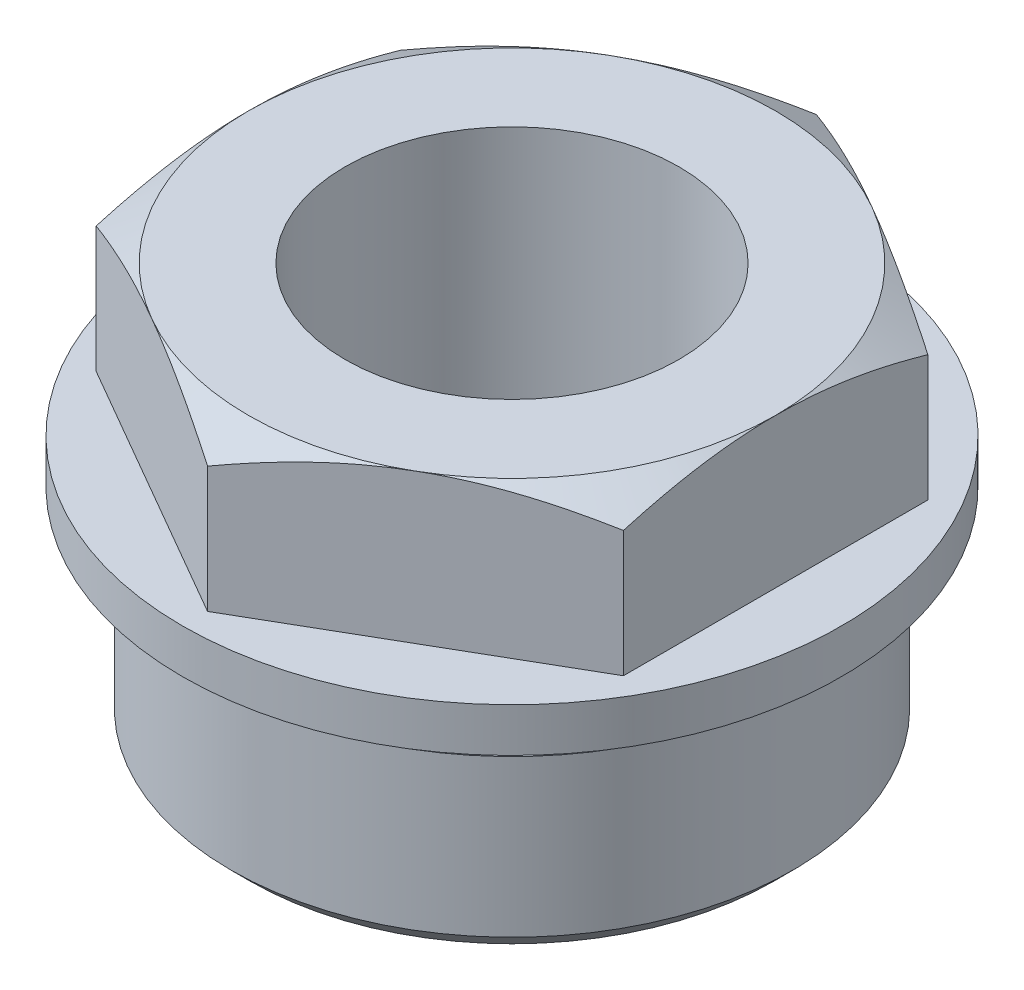
ISO-10303-21;
HEADER;
FILE_DESCRIPTION(('STEP AP214'),'2;1');
FILE_NAME('part.step','',(''),(''),'','','');
FILE_SCHEMA(('AUTOMOTIVE_DESIGN { 1 0 10303 214 1 1 1 1 }'));
ENDSEC;
DATA;
#1=APPLICATION_CONTEXT('core data for automotive mechanical design processes');
#2=APPLICATION_PROTOCOL_DEFINITION('international standard','automotive_design',2000,#1);
#3=PRODUCT_CONTEXT('',#1,'mechanical');
#4=PRODUCT('Part','Part','',(#3));
#5=PRODUCT_RELATED_PRODUCT_CATEGORY('part','',(#4));
#6=PRODUCT_DEFINITION_FORMATION('','',#4);
#7=PRODUCT_DEFINITION_CONTEXT('part definition',#1,'design');
#8=PRODUCT_DEFINITION('design','',#6,#7);
#9=PRODUCT_DEFINITION_SHAPE('','',#8);
#10=(LENGTH_UNIT() NAMED_UNIT(*) SI_UNIT(.MILLI.,.METRE.));
#11=(NAMED_UNIT(*) PLANE_ANGLE_UNIT() SI_UNIT($,.RADIAN.));
#12=(NAMED_UNIT(*) SI_UNIT($,.STERADIAN.) SOLID_ANGLE_UNIT());
#13=UNCERTAINTY_MEASURE_WITH_UNIT(LENGTH_MEASURE(1.E-05),#10,'distance_accuracy_value','');
#14=(GEOMETRIC_REPRESENTATION_CONTEXT(3) GLOBAL_UNCERTAINTY_ASSIGNED_CONTEXT((#13)) GLOBAL_UNIT_ASSIGNED_CONTEXT((#10,
#11,#12)) REPRESENTATION_CONTEXT('',''));
#15=CARTESIAN_POINT('',(0.,0.,0.));
#16=DIRECTION('',(0.,0.,1.));
#17=DIRECTION('',(1.,0.,0.));
#18=AXIS2_PLACEMENT_3D('',#15,#16,#17);
#19=CARTESIAN_POINT('',(26.5000000000002,46.,0.));
#20=DIRECTION('',(0.,-1.,0.));
#21=DIRECTION('',(0.,0.,-1.00000000000001));
#22=AXIS2_PLACEMENT_3D('',#19,#20,#21);
#23=PLANE('',#22);
#24=CARTESIAN_POINT('',(0.,46.,0.));
#25=DIRECTION('',(0.,1.,0.));
#26=DIRECTION('',(0.,0.,1.00000000000001));
#27=AXIS2_PLACEMENT_3D('',#24,#25,#26);
#28=CIRCLE('',#27,19.);
#29=CARTESIAN_POINT('',(0.,46.,19.0000000000001));
#30=VERTEX_POINT('',#29);
#31=EDGE_CURVE('E270',#30,#30,#28,.T.);
#32=ORIENTED_EDGE('',*,*,#31,.F.);
#33=EDGE_LOOP('',(#32));
#34=FACE_BOUND('',#33,.T.);
#35=CARTESIAN_POINT('',(0.,46.,0.));
#36=DIRECTION('',(0.,-1.,0.));
#37=DIRECTION('',(0.,0.,-1.00000000000001));
#38=AXIS2_PLACEMENT_3D('',#35,#36,#37);
#39=CIRCLE('',#38,30.);
#40=CARTESIAN_POINT('',(15.0000000000001,46.,-25.9807621135334));
#41=VERTEX_POINT('',#40);
#42=CARTESIAN_POINT('',(30.0000000000002,46.,0.));
#43=VERTEX_POINT('',#42);
#44=EDGE_CURVE('E68',#41,#43,#39,.T.);
#45=ORIENTED_EDGE('',*,*,#44,.F.);
#46=CARTESIAN_POINT('',(-15.0000000000001,46.,-25.9807621135334));
#47=VERTEX_POINT('',#46);
#48=EDGE_CURVE('E155',#47,#41,#39,.T.);
#49=ORIENTED_EDGE('',*,*,#48,.F.);
#50=CARTESIAN_POINT('',(-30.0000000000002,46.,0.));
#51=VERTEX_POINT('',#50);
#52=EDGE_CURVE('E152',#51,#47,#39,.T.);
#53=ORIENTED_EDGE('',*,*,#52,.F.);
#54=CARTESIAN_POINT('',(-15.0000000000001,46.,25.9807621135334));
#55=VERTEX_POINT('',#54);
#56=EDGE_CURVE('E151',#55,#51,#39,.T.);
#57=ORIENTED_EDGE('',*,*,#56,.F.);
#58=CARTESIAN_POINT('',(15.0000000000001,46.,25.9807621135334));
#59=VERTEX_POINT('',#58);
#60=EDGE_CURVE('E131',#59,#55,#39,.T.);
#61=ORIENTED_EDGE('',*,*,#60,.F.);
#62=EDGE_CURVE('E121',#43,#59,#39,.T.);
#63=ORIENTED_EDGE('',*,*,#62,.F.);
#64=EDGE_LOOP('',(#45,#49,#53,#57,#61,#63));
#65=FACE_BOUND('',#64,.T.);
#66=ADVANCED_FACE('F49',(#34,#65),#23,.F.);
#67=CARTESIAN_POINT('',(30.0000000000002,46.,17.3205080756889));
#68=DIRECTION('',(-1.00000000000001,0.,0.));
#69=DIRECTION('',(0.,0.,1.00000000000001));
#70=AXIS2_PLACEMENT_3D('',#67,#68,#69);
#71=PLANE('',#70);
#72=CARTESIAN_POINT('',(30.0000000000001,31.239606090176,-46.7712819646018));
#73=CARTESIAN_POINT('',(30.0000000000002,31.5584687448088,-46.1151297675261));
#74=CARTESIAN_POINT('',(30.0000000000002,31.8757643867478,-45.4582138124259));
#75=CARTESIAN_POINT('',(30.0000000000002,32.5068572860207,-44.1426960555676));
#76=CARTESIAN_POINT('',(30.0000000000002,32.8206545089148,-43.4840942372916));
#77=CARTESIAN_POINT('',(30.0000000000002,33.4444271760729,-42.16495939762));
#78=CARTESIAN_POINT('',(30.0000000000002,33.7544020340731,-41.5044260987362));
#79=CARTESIAN_POINT('',(30.0000000000002,34.3700431687671,-40.1813574056565));
#80=CARTESIAN_POINT('',(30.0000000000002,34.6757094551645,-39.5188220159737));
#81=CARTESIAN_POINT('',(30.0000000000002,35.5887791275013,-37.5208295363821));
#82=CARTESIAN_POINT('',(30.0000000000002,36.1889082784954,-36.1820344642029));
#83=CARTESIAN_POINT('',(30.0000000000002,37.3649692433764,-33.4938786164809));
#84=CARTESIAN_POINT('',(30.0000000000002,37.9409021839278,-32.1445183363717));
#85=CARTESIAN_POINT('',(30.0000000000002,38.7909979851776,-30.0886765711821));
#86=CARTESIAN_POINT('',(30.0000000000002,39.0764148085031,-29.3868443951254));
#87=CARTESIAN_POINT('',(30.0000000000002,39.6379415544381,-27.9794711168769));
#88=CARTESIAN_POINT('',(30.0000000000002,39.914051614517,-27.2739300696465));
#89=CARTESIAN_POINT('',(30.0000000000002,40.4557471475397,-25.8587028040617));
#90=CARTESIAN_POINT('',(30.0000000000002,40.7213311997532,-25.1490160408786));
#91=CARTESIAN_POINT('',(30.0000000000002,41.240478478545,-23.7252560579688));
#92=CARTESIAN_POINT('',(30.0000000000002,41.4940417532633,-23.0111828558215));
#93=CARTESIAN_POINT('',(30.0000000000002,41.9869978610835,-21.5797436345363));
#94=CARTESIAN_POINT('',(30.0000000000002,42.226418146127,-20.8623871159705));
#95=CARTESIAN_POINT('',(30.0000000000002,42.6897530114855,-19.4226978318921));
#96=CARTESIAN_POINT('',(30.0000000000002,42.9136673272634,-18.7003649817126));
#97=CARTESIAN_POINT('',(30.0000000000002,43.5589575300168,-16.5258517009773));
#98=CARTESIAN_POINT('',(30.0000000000002,43.9540701330207,-15.0656156625462));
#99=CARTESIAN_POINT('',(30.0000000000002,44.4788191601853,-12.8635430521492));
#100=CARTESIAN_POINT('',(30.0000000000002,44.6420535379972,-12.1296310543223));
#101=CARTESIAN_POINT('',(30.0000000000002,44.9439641262004,-10.6567407203549));
#102=CARTESIAN_POINT('',(30.0000000000002,45.0826408291056,-9.91776248612859));
#103=CARTESIAN_POINT('',(30.0000000000002,45.3330012133777,-8.43525328781891));
#104=CARTESIAN_POINT('',(30.0000000000002,45.4446858599884,-7.69172248751187));
#105=CARTESIAN_POINT('',(30.0000000000002,45.6388508580685,-6.20083058790578));
#106=CARTESIAN_POINT('',(30.0000000000002,45.721331231571,-5.45346949149691));
#107=CARTESIAN_POINT('',(30.0000000000002,45.8543941047253,-3.96587006600816));
#108=CARTESIAN_POINT('',(30.0000000000002,45.9053844576528,-3.22566843529052));
#109=CARTESIAN_POINT('',(30.0000000000002,45.9760031688682,-1.74377072428046));
#110=CARTESIAN_POINT('',(30.0000000000002,45.9956320543405,-1.00207466931908));
#111=CARTESIAN_POINT('',(30.0000000000002,46.003064011847,0.481476307233653));
#112=CARTESIAN_POINT('',(30.0000000000002,45.9908670135502,1.22333122917246));
#113=CARTESIAN_POINT('',(30.0000000000002,45.9349326768346,2.70588775153423));
#114=CARTESIAN_POINT('',(30.0000000000002,45.8911939281505,3.44658929890457));
#115=CARTESIAN_POINT('',(30.0000000000002,45.790980313849,4.70266701347159));
#116=CARTESIAN_POINT('',(30.0000000000002,45.7423151475744,5.21868236424298));
#117=CARTESIAN_POINT('',(30.0000000000002,45.6306254228116,6.249162488353));
#118=CARTESIAN_POINT('',(30.0000000000002,45.5676004736487,6.76362721911927));
#119=CARTESIAN_POINT('',(30.0000000000002,45.3579018278731,8.30428874215557));
#120=CARTESIAN_POINT('',(30.0000000000002,45.1906061789717,9.32773034867537));
#121=CARTESIAN_POINT('',(30.0000000000002,44.8069407991703,11.3660247843504));
#122=CARTESIAN_POINT('',(30.0000000000002,44.5905335158633,12.3808704215439));
#123=CARTESIAN_POINT('',(30.0000000000002,44.1152707446625,14.4004832336886));
#124=CARTESIAN_POINT('',(30.0000000000002,43.8564158424033,15.4052505474839));
#125=CARTESIAN_POINT('',(30.0000000000002,43.2964152806087,17.4269084380743));
#126=CARTESIAN_POINT('',(30.0000000000002,42.9944578984081,18.4435724953574));
#127=CARTESIAN_POINT('',(30.0000000000002,42.358852378075,20.4668884277303));
#128=CARTESIAN_POINT('',(30.0000000000002,42.0252040282062,21.4735402358759));
#129=CARTESIAN_POINT('',(30.0000000000002,41.3315556576805,23.4773282017244));
#130=CARTESIAN_POINT('',(30.0000000000002,40.9715640722066,24.4744672908278));
#131=CARTESIAN_POINT('',(30.0000000000002,40.4150258557419,25.9639422432157));
#132=CARTESIAN_POINT('',(30.0000000000002,40.2267547362052,26.4593947158606));
#133=CARTESIAN_POINT('',(30.0000000000002,39.8451547473929,27.4483513648799));
#134=CARTESIAN_POINT('',(30.0000000000002,39.6518258624581,27.9418555352166));
#135=CARTESIAN_POINT('',(30.0000000000002,39.1837723709218,29.1203359232276));
#136=CARTESIAN_POINT('',(30.0000000000002,38.9068787245018,29.8044507215683));
#137=CARTESIAN_POINT('',(30.0000000000002,38.3451610691755,31.16942037891));
#138=CARTESIAN_POINT('',(30.0000000000002,38.0603369517343,31.8502751931459));
#139=CARTESIAN_POINT('',(30.0000000000002,37.1953226039201,33.8884385344727));
#140=CARTESIAN_POINT('',(30.0000000000002,36.6046135218582,35.2412881388174));
#141=CARTESIAN_POINT('',(30.0000000000002,35.400896481604,37.9373671896756));
#142=CARTESIAN_POINT('',(30.0000000000002,34.7878832368943,39.2805942639722));
#143=CARTESIAN_POINT('',(30.0000000000002,33.5440976205148,41.9587483647647));
#144=CARTESIAN_POINT('',(30.0000000000002,32.9133256560293,43.2936755807101));
#145=CARTESIAN_POINT('',(30.0000000000002,31.636659821909,45.958149444346));
#146=CARTESIAN_POINT('',(30.0000000000002,30.9907494270812,47.2876881579735));
#147=CARTESIAN_POINT('',(30.0000000000002,29.6871189830311,49.9409628653107));
#148=CARTESIAN_POINT('',(30.0000000000002,29.0293988792445,51.264698832175));
#149=CARTESIAN_POINT('',(30.0000000000002,27.7042847418028,53.907091228546));
#150=CARTESIAN_POINT('',(30.0000000000002,27.0368920227889,55.2257483180707));
#151=CARTESIAN_POINT('',(30.0000000000002,25.693958597624,57.8589000938369));
#152=CARTESIAN_POINT('',(30.0000000000002,25.0184179076171,59.173394788319));
#153=CARTESIAN_POINT('',(30.0000000000002,23.7186547125148,61.6863411406712));
#154=CARTESIAN_POINT('',(30.0000000000002,23.0949952422964,62.8850842385073));
#155=CARTESIAN_POINT('',(30.0000000000002,21.8427272486062,65.2799834863157));
#156=CARTESIAN_POINT('',(30.0000000000002,21.2141187171461,66.4761396321085));
#157=CARTESIAN_POINT('',(30.0000000000002,19.3218480221743,70.0613141116929));
#158=CARTESIAN_POINT('',(30.0000000000002,18.0517840515527,72.4469550235698));
#159=CARTESIAN_POINT('',(30.0000000000002,16.1385812103087,76.0170792666995));
#160=CARTESIAN_POINT('',(30.0000000000002,15.5003323985778,77.2041902670028));
#161=CARTESIAN_POINT('',(30.0000000000002,14.2209596587582,79.5768632930373));
#162=CARTESIAN_POINT('',(30.0000000000002,13.5798357296874,80.762425318239));
#163=CARTESIAN_POINT('',(30.0000000000002,12.2950866509177,83.1321046752538));
#164=CARTESIAN_POINT('',(30.0000000000002,11.6514616468602,84.3162220860654));
#165=CARTESIAN_POINT('',(30.0000000000002,10.3619460879779,86.6832203951813));
#166=CARTESIAN_POINT('',(30.0000000000002,9.7160555366616,87.866101295397));
#167=CARTESIAN_POINT('',(30.0000000000001,9.06916733564153,89.0484357879371));
#168=B_SPLINE_CURVE_WITH_KNOTS('',3,(#72,#73,#74,#75,#76,#77,#78,#79,#80,#81,#82,#83,#84,#85,
#86,#87,#88,#89,#90,#91,#92,#93,#94,#95,#96,#97,#98,#99,#100,#101,#102,#103,#104,#105,#106,#107,
#108,#109,#110,#111,#112,#113,#114,#115,#116,#117,#118,#119,#120,#121,#122,#123,#124,#125,#126,
#127,#128,#129,#130,#131,#132,#133,#134,#135,#136,#137,#138,#139,#140,#141,#142,#143,#144,#145,
#146,#147,#148,#149,#150,#151,#152,#153,#154,#155,#156,#157,#158,#159,#160,#161,#162,#163,#164,
#165,#166,#167),.UNSPECIFIED.,.F.,.F.,(4,2,2,2,2,2,2,2,2,2,2,2,2,2,2,2,2,2,2,2,2,2,2,2,2,2,2,2,
2,2,2,2,2,2,2,2,2,2,2,2,2,2,2,2,2,2,2,4),(0.,2.18858068266818,4.37718289159747,6.56611670840002,
8.75504559458201,13.1563067705084,17.5573627798744,19.8302541446687,22.103111922088,
24.3762754371637,26.6494298480528,28.9180162945692,31.186641434431,35.7221738109183,
37.9773813752811,40.2325437054496,42.4876253784291,44.7427053500612,46.9679292743305,
49.1931157923359,51.4183072277246,53.6435981599667,55.1983161665015,56.7530764760176,
59.8626647795073,62.9746388381711,66.0865699656556,69.2676306215483,72.4487125325011,
75.6287802713502,77.2188126469495,78.8088499460205,81.0228697118069,83.2369197931497,
87.6652067600132,92.0945502426658,96.523792248825,100.958117904936,105.392464054175,
109.826213063956,114.2599532904,118.313756266673,122.367565787572,130.475466895434,
134.518897380069,138.56232924618,142.605529083621,146.648722662373),.UNSPECIFIED.);
#169=CARTESIAN_POINT('',(30.0000000000002,43.3205080756888,17.3205080756889));
#170=VERTEX_POINT('',#169);
#171=EDGE_CURVE('E127',#170,#43,#168,.F.);
#172=ORIENTED_EDGE('',*,*,#171,.F.);
#173=DIRECTION('',(0.,-1.,0.));
#174=VECTOR('',#173,1.);
#175=CARTESIAN_POINT('',(30.0000000000002,137.651513899117,17.3205080756889));
#176=LINE('',#175,#174);
#177=CARTESIAN_POINT('',(30.0000000000001,29.,17.3205080756889));
#178=VERTEX_POINT('',#177);
#179=EDGE_CURVE('E147',#170,#178,#176,.T.);
#180=ORIENTED_EDGE('',*,*,#179,.T.);
#181=DIRECTION('',(0.,0.,-1.00000000000001));
#182=VECTOR('',#181,1.);
#183=CARTESIAN_POINT('',(30.0000000000001,29.,17.3205080756889));
#184=LINE('',#183,#182);
#185=CARTESIAN_POINT('',(30.0000000000001,29.,-17.3205080756889));
#186=VERTEX_POINT('',#185);
#187=EDGE_CURVE('E267',#178,#186,#184,.T.);
#188=ORIENTED_EDGE('',*,*,#187,.T.);
#189=DIRECTION('',(0.,-1.,0.));
#190=VECTOR('',#189,1.);
#191=CARTESIAN_POINT('',(30.0000000000002,137.651513899117,-17.3205080756888));
#192=LINE('',#191,#190);
#193=CARTESIAN_POINT('',(30.0000000000002,43.3205080756888,-17.3205080756889));
#194=VERTEX_POINT('',#193);
#195=EDGE_CURVE('E315',#194,#186,#192,.T.);
#196=ORIENTED_EDGE('',*,*,#195,.F.);
#197=EDGE_CURVE('E162',#43,#194,#168,.F.);
#198=ORIENTED_EDGE('',*,*,#197,.F.);
#199=EDGE_LOOP('',(#172,#180,#188,#196,#198));
#200=FACE_BOUND('',#199,.T.);
#201=ADVANCED_FACE('F178',(#200),#71,.F.);
#202=CARTESIAN_POINT('',(0.,46.,34.6410161513778));
#203=DIRECTION('',(-0.500000000000003,0.,-0.866025403784445));
#204=DIRECTION('',(-0.866025403784445,0.,0.500000000000003));
#205=AXIS2_PLACEMENT_3D('',#202,#203,#204);
#206=PLANE('',#205);
#207=CARTESIAN_POINT('',(-0.000199999999988119,43.3204414086888,34.6411316214316));
#208=CARTESIAN_POINT('',(0.659186525557407,43.5402203311054,34.260434633401));
#209=CARTESIAN_POINT('',(1.32114500943037,43.7500259061146,33.8782527245446));
#210=CARTESIAN_POINT('',(2.65037008425806,44.1469181469043,33.1108242697792));
#211=CARTESIAN_POINT('',(3.31763834458853,44.3339973405019,32.7255767600557));
#212=CARTESIAN_POINT('',(4.65878677635735,44.6829257656526,31.9512643519508));
#213=CARTESIAN_POINT('',(5.33267879099742,44.8447147472277,31.5621926158936));
#214=CARTESIAN_POINT('',(6.6851167611463,45.1395774383583,30.7813621897659));
#215=CARTESIAN_POINT('',(7.36366224608091,45.272654008486,30.3896037713815));
#216=CARTESIAN_POINT('',(8.70806302803091,45.504442984088,29.6134136180239));
#217=CARTESIAN_POINT('',(9.37381860500326,45.6039219186911,29.2290394564444));
#218=CARTESIAN_POINT('',(10.7083802826266,45.7707251166872,28.4585299126184));
#219=CARTESIAN_POINT('',(11.3771864417478,45.8380487611266,28.0723944966141));
#220=CARTESIAN_POINT('',(12.7159221665993,45.93884151169,27.2994750654973));
#221=CARTESIAN_POINT('',(13.3858494453991,45.9723508463518,26.9126923707448));
#222=CARTESIAN_POINT('',(14.7263223205433,46.0047942931646,26.1387699954389));
#223=CARTESIAN_POINT('',(15.3968678971403,46.003729473752,25.7516303262867));
#224=CARTESIAN_POINT('',(16.650459503705,45.9694399503114,25.0278688747828));
#225=CARTESIAN_POINT('',(17.2335948812431,45.9403965385324,24.6911955075871));
#226=CARTESIAN_POINT('',(18.3984749190376,45.8567123805129,24.0186517041928));
#227=CARTESIAN_POINT('',(18.9802195990946,45.8020720009268,23.6827812565623));
#228=CARTESIAN_POINT('',(20.1420964286621,45.6681440818065,23.0119713562463));
#229=CARTESIAN_POINT('',(20.722226639514,45.5888342550569,22.6770330228459));
#230=CARTESIAN_POINT('',(21.8797295892506,45.4069590542184,22.0087483832277));
#231=CARTESIAN_POINT('',(22.4571023398069,45.3043937786527,21.6754020702713));
#232=CARTESIAN_POINT('',(23.6213483105994,45.0751250350097,21.0032243456313));
#233=CARTESIAN_POINT('',(24.2081498990516,44.9479386998341,20.6644342905775));
#234=CARTESIAN_POINT('',(25.378161584323,44.6728211494683,19.9889277291311));
#235=CARTESIAN_POINT('',(25.961371183192,44.5248871227585,19.6522115102301));
#236=CARTESIAN_POINT('',(27.122831325468,44.2105128814925,18.981642184434));
#237=CARTESIAN_POINT('',(27.7010892596951,44.0441088802872,18.647784810447));
#238=CARTESIAN_POINT('',(28.8536055653687,43.6944548086621,17.9823792111209));
#239=CARTESIAN_POINT('',(29.4278650152743,43.5112094862418,17.6508303631332));
#240=CARTESIAN_POINT('',(30.0002000000002,43.3204414086888,17.320392605635));
#241=B_SPLINE_CURVE_WITH_KNOTS('',3,(#207,#208,#209,#210,#211,#212,#213,#214,#215,#216,#217,
#218,#219,#220,#221,#222,#223,#224,#225,#226,#227,#228,#229,#230,#231,#232,#233,#234,#235,#236,
#237,#238,#239,#240),.UNSPECIFIED.,.F.,.F.,(4,2,2,2,2,2,2,2,2,2,2,2,2,2,2,2,4),(0.,
2.37750032904935,4.75578025029283,7.13964242705026,9.52326699360544,11.8481083974673,
14.172994550143,16.4951115370995,18.8171567643376,20.8385880600118,22.8599904013275,
24.8832242763788,26.9064495800128,28.9743372865567,31.042505483789,33.1066880391163,
35.1702904233234),.UNSPECIFIED.);
#242=CARTESIAN_POINT('',(0.,43.3205080756888,34.6410161513777));
#243=VERTEX_POINT('',#242);
#244=EDGE_CURVE('E135',#243,#59,#241,.T.);
#245=ORIENTED_EDGE('',*,*,#244,.F.);
#246=DIRECTION('',(0.,-1.,0.));
#247=VECTOR('',#246,1.);
#248=CARTESIAN_POINT('',(0.,137.651513899117,34.6410161513776));
#249=LINE('',#248,#247);
#250=CARTESIAN_POINT('',(0.,29.,34.6410161513778));
#251=VERTEX_POINT('',#250);
#252=EDGE_CURVE('E322',#243,#251,#249,.T.);
#253=ORIENTED_EDGE('',*,*,#252,.T.);
#254=DIRECTION('',(0.866025403784445,0.,-0.500000000000003));
#255=VECTOR('',#254,1.);
#256=CARTESIAN_POINT('',(0.,29.,34.6410161513778));
#257=LINE('',#256,#255);
#258=EDGE_CURVE('E273',#251,#178,#257,.T.);
#259=ORIENTED_EDGE('',*,*,#258,.T.);
#260=ORIENTED_EDGE('',*,*,#179,.F.);
#261=EDGE_CURVE('E125',#59,#170,#241,.T.);
#262=ORIENTED_EDGE('',*,*,#261,.F.);
#263=EDGE_LOOP('',(#245,#253,#259,#260,#262));
#264=FACE_BOUND('',#263,.T.);
#265=ADVANCED_FACE('F145',(#264),#206,.F.);
#266=CARTESIAN_POINT('',(-30.0000000000002,46.,17.3205080756889));
#267=DIRECTION('',(0.500000000000003,0.,-0.866025403784445));
#268=DIRECTION('',(-0.866025403784445,0.,-0.500000000000004));
#269=AXIS2_PLACEMENT_3D('',#266,#267,#268);
#270=PLANE('',#269);
#271=CARTESIAN_POINT('',(-30.0002000000002,43.3204414086888,17.320392605635));
#272=CARTESIAN_POINT('',(-29.3408134744428,43.5402203311054,17.7010895936656));
#273=CARTESIAN_POINT('',(-28.6788549905698,43.7500259061146,18.083271502522));
#274=CARTESIAN_POINT('',(-27.3496299157421,44.1469181469043,18.8506999572874));
#275=CARTESIAN_POINT('',(-26.6823616554116,44.333997340502,19.2359474670109));
#276=CARTESIAN_POINT('',(-25.3412132236428,44.6829257656526,20.0102598751159));
#277=CARTESIAN_POINT('',(-24.6673212090027,44.8447147472277,20.399331611173));
#278=CARTESIAN_POINT('',(-23.3148832388539,45.1395774383583,21.1801620373008));
#279=CARTESIAN_POINT('',(-22.6363377539193,45.272654008486,21.5719204556852));
#280=CARTESIAN_POINT('',(-21.2919369719693,45.5044429840881,22.3481106090428));
#281=CARTESIAN_POINT('',(-20.6261813949969,45.6039219186911,22.7324847706222));
#282=CARTESIAN_POINT('',(-19.2916197173735,45.7707251166872,23.5029943144482));
#283=CARTESIAN_POINT('',(-18.6228135582523,45.8380487611266,23.8891297304526));
#284=CARTESIAN_POINT('',(-17.2840778334008,45.9388415116901,24.6620491615693));
#285=CARTESIAN_POINT('',(-16.6141505546011,45.9723508463518,25.0488318563218));
#286=CARTESIAN_POINT('',(-15.2736776794569,46.0047942931646,25.8227542316278));
#287=CARTESIAN_POINT('',(-14.6031321028598,46.003729473752,26.20989390078));
#288=CARTESIAN_POINT('',(-13.3495404962952,45.9694399503114,26.933655352284));
#289=CARTESIAN_POINT('',(-12.7664051187571,45.9403965385324,27.2703287194795));
#290=CARTESIAN_POINT('',(-11.6015250809625,45.856712380513,27.9428725228738));
#291=CARTESIAN_POINT('',(-11.0197804009055,45.8020720009268,28.2787429705044));
#292=CARTESIAN_POINT('',(-9.85790357133802,45.6681440818065,28.9495528708204));
#293=CARTESIAN_POINT('',(-9.27777336048611,45.588834255057,29.2844912042207));
#294=CARTESIAN_POINT('',(-8.12027041074949,45.4069590542184,29.952775843839));
#295=CARTESIAN_POINT('',(-7.5428976601932,45.3043937786527,30.2861221567954));
#296=CARTESIAN_POINT('',(-6.3786516894007,45.0751250350097,30.9582998814354));
#297=CARTESIAN_POINT('',(-5.79185010094859,44.9479386998342,31.2970899364891));
#298=CARTESIAN_POINT('',(-4.62183841567714,44.6728211494683,31.9725964979356));
#299=CARTESIAN_POINT('',(-4.03862881680816,44.5248871227585,32.3093127168366));
#300=CARTESIAN_POINT('',(-2.8771686745322,44.2105128814925,32.9798820426326));
#301=CARTESIAN_POINT('',(-2.29891074030503,44.0441088802872,33.3137394166197));
#302=CARTESIAN_POINT('',(-1.14639443463143,43.6944548086621,33.9791450159458));
#303=CARTESIAN_POINT('',(-0.572134984725888,43.5112094862418,34.3106938639334));
#304=CARTESIAN_POINT('',(0.000200000000012978,43.3204414086888,34.6411316214316));
#305=B_SPLINE_CURVE_WITH_KNOTS('',3,(#271,#272,#273,#274,#275,#276,#277,#278,#279,#280,#281,
#282,#283,#284,#285,#286,#287,#288,#289,#290,#291,#292,#293,#294,#295,#296,#297,#298,#299,#300,
#301,#302,#303,#304),.UNSPECIFIED.,.F.,.F.,(4,2,2,2,2,2,2,2,2,2,2,2,2,2,2,2,4),(0.,
2.37750032904935,4.75578025029285,7.13964242705028,9.52326699360546,11.8481083974673,
14.172994550143,16.4951115370995,18.8171567643376,20.8385880600118,22.8599904013275,
24.8832242763788,26.9064495800128,28.9743372865567,31.0425054837891,33.1066880391164,
35.1702904233234),.UNSPECIFIED.);
#306=CARTESIAN_POINT('',(-30.0000000000002,43.3205080756888,17.3205080756889));
#307=VERTEX_POINT('',#306);
#308=EDGE_CURVE('E318',#307,#55,#305,.T.);
#309=ORIENTED_EDGE('',*,*,#308,.F.);
#310=DIRECTION('',(0.,-1.,0.));
#311=VECTOR('',#310,1.);
#312=CARTESIAN_POINT('',(-30.0000000000002,137.651513899117,17.3205080756889));
#313=LINE('',#312,#311);
#314=CARTESIAN_POINT('',(-30.0000000000002,29.,17.3205080756889));
#315=VERTEX_POINT('',#314);
#316=EDGE_CURVE('E316',#307,#315,#313,.T.);
#317=ORIENTED_EDGE('',*,*,#316,.T.);
#318=DIRECTION('',(0.866025403784445,0.,0.500000000000004));
#319=VECTOR('',#318,1.);
#320=CARTESIAN_POINT('',(-30.0000000000002,29.,17.3205080756889));
#321=LINE('',#320,#319);
#322=EDGE_CURVE('E331',#315,#251,#321,.T.);
#323=ORIENTED_EDGE('',*,*,#322,.T.);
#324=ORIENTED_EDGE('',*,*,#252,.F.);
#325=EDGE_CURVE('E139',#55,#243,#305,.T.);
#326=ORIENTED_EDGE('',*,*,#325,.F.);
#327=EDGE_LOOP('',(#309,#317,#323,#324,#326));
#328=FACE_BOUND('',#327,.T.);
#329=ADVANCED_FACE('F200',(#328),#270,.F.);
#330=CARTESIAN_POINT('',(-30.0000000000002,46.,-17.3205080756889));
#331=DIRECTION('',(1.00000000000001,0.,0.));
#332=DIRECTION('',(0.,0.,-1.00000000000001));
#333=AXIS2_PLACEMENT_3D('',#330,#331,#332);
#334=PLANE('',#333);
#335=CARTESIAN_POINT('',(-30.0000000000002,31.239606090176,-46.7712819646018));
#336=CARTESIAN_POINT('',(-30.0000000000002,31.5584687448088,-46.1151297675261));
#337=CARTESIAN_POINT('',(-30.0000000000002,31.8757643867478,-45.4582138124259));
#338=CARTESIAN_POINT('',(-30.0000000000002,32.5068572860208,-44.1426960555676));
#339=CARTESIAN_POINT('',(-30.0000000000002,32.8206545089148,-43.4840942372916));
#340=CARTESIAN_POINT('',(-30.0000000000002,33.4444271760729,-42.16495939762));
#341=CARTESIAN_POINT('',(-30.0000000000002,33.7544020340731,-41.5044260987362));
#342=CARTESIAN_POINT('',(-30.0000000000002,34.3700431687671,-40.1813574056565));
#343=CARTESIAN_POINT('',(-30.0000000000002,34.6757094551645,-39.5188220159737));
#344=CARTESIAN_POINT('',(-30.0000000000002,35.5887791275013,-37.5208295363821));
#345=CARTESIAN_POINT('',(-30.0000000000002,36.1889082784954,-36.1820344642029));
#346=CARTESIAN_POINT('',(-30.0000000000002,37.3649692433764,-33.4938786164808));
#347=CARTESIAN_POINT('',(-30.0000000000002,37.9409021839278,-32.1445183363717));
#348=CARTESIAN_POINT('',(-30.0000000000002,38.7909979851776,-30.0886765711821));
#349=CARTESIAN_POINT('',(-30.0000000000002,39.0764148085031,-29.3868443951254));
#350=CARTESIAN_POINT('',(-30.0000000000002,39.6379415544381,-27.9794711168769));
#351=CARTESIAN_POINT('',(-30.0000000000002,39.914051614517,-27.2739300696465));
#352=CARTESIAN_POINT('',(-30.0000000000002,40.4557471475397,-25.8587028040617));
#353=CARTESIAN_POINT('',(-30.0000000000002,40.7213311997532,-25.1490160408786));
#354=CARTESIAN_POINT('',(-30.0000000000002,41.240478478545,-23.7252560579687));
#355=CARTESIAN_POINT('',(-30.0000000000002,41.4940417532633,-23.0111828558215));
#356=CARTESIAN_POINT('',(-30.0000000000002,41.9869978610835,-21.5797436345363));
#357=CARTESIAN_POINT('',(-30.0000000000002,42.226418146127,-20.8623871159705));
#358=CARTESIAN_POINT('',(-30.0000000000002,42.6897530114855,-19.4226978318921));
#359=CARTESIAN_POINT('',(-30.0000000000002,42.9136673272634,-18.7003649817126));
#360=CARTESIAN_POINT('',(-30.0000000000002,43.5589575300168,-16.5258517009773));
#361=CARTESIAN_POINT('',(-30.0000000000002,43.9540701330207,-15.0656156625462));
#362=CARTESIAN_POINT('',(-30.0000000000002,44.4788191601853,-12.8635430521491));
#363=CARTESIAN_POINT('',(-30.0000000000002,44.6420535379972,-12.1296310543223));
#364=CARTESIAN_POINT('',(-30.0000000000002,44.9439641262005,-10.6567407203549));
#365=CARTESIAN_POINT('',(-30.0000000000002,45.0826408291056,-9.91776248612856));
#366=CARTESIAN_POINT('',(-30.0000000000002,45.3330012133777,-8.43525328781887));
#367=CARTESIAN_POINT('',(-30.0000000000002,45.4446858599884,-7.69172248751184));
#368=CARTESIAN_POINT('',(-30.0000000000002,45.6388508580685,-6.20083058790574));
#369=CARTESIAN_POINT('',(-30.0000000000002,45.721331231571,-5.45346949149688));
#370=CARTESIAN_POINT('',(-30.0000000000002,45.8543941047253,-3.96587006600813));
#371=CARTESIAN_POINT('',(-30.0000000000002,45.9053844576528,-3.22566843529049));
#372=CARTESIAN_POINT('',(-30.0000000000002,45.9760031688682,-1.74377072428043));
#373=CARTESIAN_POINT('',(-30.0000000000002,45.9956320543405,-1.00207466931905));
#374=CARTESIAN_POINT('',(-30.0000000000002,46.003064011847,0.481476307233685));
#375=CARTESIAN_POINT('',(-30.0000000000002,45.9908670135502,1.22333122917249));
#376=CARTESIAN_POINT('',(-30.0000000000002,45.9349326768346,2.70588775153427));
#377=CARTESIAN_POINT('',(-30.0000000000002,45.8911939281505,3.44658929890459));
#378=CARTESIAN_POINT('',(-30.0000000000002,45.790980313849,4.70266701347162));
#379=CARTESIAN_POINT('',(-30.0000000000002,45.7423151475744,5.218682364243));
#380=CARTESIAN_POINT('',(-30.0000000000002,45.6306254228116,6.24916248835302));
#381=CARTESIAN_POINT('',(-30.0000000000002,45.5676004736487,6.76362721911929));
#382=CARTESIAN_POINT('',(-30.0000000000002,45.3579018278731,8.30428874215559));
#383=CARTESIAN_POINT('',(-30.0000000000002,45.1906061789717,9.3277303486754));
#384=CARTESIAN_POINT('',(-30.0000000000002,44.8069407991703,11.3660247843504));
#385=CARTESIAN_POINT('',(-30.0000000000002,44.5905335158633,12.3808704215439));
#386=CARTESIAN_POINT('',(-30.0000000000002,44.1152707446625,14.4004832336886));
#387=CARTESIAN_POINT('',(-30.0000000000002,43.8564158424032,15.4052505474839));
#388=CARTESIAN_POINT('',(-30.0000000000002,43.2964152806087,17.4269084380743));
#389=CARTESIAN_POINT('',(-30.0000000000002,42.9944578984081,18.4435724953574));
#390=CARTESIAN_POINT('',(-30.0000000000002,42.358852378075,20.4668884277304));
#391=CARTESIAN_POINT('',(-30.0000000000002,42.0252040282062,21.473540235876));
#392=CARTESIAN_POINT('',(-30.0000000000002,41.3315556576804,23.4773282017245));
#393=CARTESIAN_POINT('',(-30.0000000000002,40.9715640722066,24.4744672908278));
#394=CARTESIAN_POINT('',(-30.0000000000002,40.4150258557419,25.9639422432158));
#395=CARTESIAN_POINT('',(-30.0000000000002,40.2267547362051,26.4593947158607));
#396=CARTESIAN_POINT('',(-30.0000000000002,39.8451547473929,27.4483513648799));
#397=CARTESIAN_POINT('',(-30.0000000000002,39.6518258624581,27.9418555352166));
#398=CARTESIAN_POINT('',(-30.0000000000002,39.1837723709218,29.1203359232277));
#399=CARTESIAN_POINT('',(-30.0000000000002,38.9068787245018,29.8044507215684));
#400=CARTESIAN_POINT('',(-30.0000000000002,38.3451610691754,31.1694203789101));
#401=CARTESIAN_POINT('',(-30.0000000000002,38.0603369517342,31.8502751931459));
#402=CARTESIAN_POINT('',(-30.0000000000002,37.1953226039201,33.8884385344728));
#403=CARTESIAN_POINT('',(-30.0000000000002,36.6046135218582,35.2412881388174));
#404=CARTESIAN_POINT('',(-30.0000000000002,35.400896481604,37.9373671896757));
#405=CARTESIAN_POINT('',(-30.0000000000002,34.7878832368942,39.2805942639723));
#406=CARTESIAN_POINT('',(-30.0000000000002,33.5440976205147,41.9587483647648));
#407=CARTESIAN_POINT('',(-30.0000000000002,32.9133256560292,43.2936755807102));
#408=CARTESIAN_POINT('',(-30.0000000000002,31.6366598219089,45.9581494443461));
#409=CARTESIAN_POINT('',(-30.0000000000002,30.9907494270812,47.2876881579735));
#410=CARTESIAN_POINT('',(-30.0000000000002,29.6871189830311,49.9409628653108));
#411=CARTESIAN_POINT('',(-30.0000000000002,29.0293988792445,51.264698832175));
#412=CARTESIAN_POINT('',(-30.0000000000002,27.7042847418028,53.9070912285461));
#413=CARTESIAN_POINT('',(-30.0000000000002,27.0368920227888,55.2257483180707));
#414=CARTESIAN_POINT('',(-30.0000000000002,25.693958597624,57.8589000938369));
#415=CARTESIAN_POINT('',(-30.0000000000002,25.0184179076171,59.1733947883191));
#416=CARTESIAN_POINT('',(-30.0000000000002,23.7186547125148,61.6863411406712));
#417=CARTESIAN_POINT('',(-30.0000000000002,23.0949952422963,62.8850842385073));
#418=CARTESIAN_POINT('',(-30.0000000000002,21.8427272486061,65.2799834863158));
#419=CARTESIAN_POINT('',(-30.0000000000002,21.2141187171461,66.4761396321086));
#420=CARTESIAN_POINT('',(-30.0000000000002,19.3218480221743,70.0613141116929));
#421=CARTESIAN_POINT('',(-30.0000000000002,18.0517840515527,72.4469550235698));
#422=CARTESIAN_POINT('',(-30.0000000000002,16.1385812103087,76.0170792666995));
#423=CARTESIAN_POINT('',(-30.0000000000002,15.5003323985778,77.2041902670028));
#424=CARTESIAN_POINT('',(-30.0000000000002,14.2209596587582,79.5768632930373));
#425=CARTESIAN_POINT('',(-30.0000000000002,13.5798357296874,80.762425318239));
#426=CARTESIAN_POINT('',(-30.0000000000002,12.2950866509177,83.1321046752538));
#427=CARTESIAN_POINT('',(-30.0000000000002,11.6514616468602,84.3162220860654));
#428=CARTESIAN_POINT('',(-30.0000000000002,10.3619460879779,86.6832203951814));
#429=CARTESIAN_POINT('',(-30.0000000000002,9.71605553666159,87.866101295397));
#430=CARTESIAN_POINT('',(-30.0000000000002,9.06916733564152,89.0484357879371));
#431=B_SPLINE_CURVE_WITH_KNOTS('',3,(#335,#336,#337,#338,#339,#340,#341,#342,#343,#344,#345,
#346,#347,#348,#349,#350,#351,#352,#353,#354,#355,#356,#357,#358,#359,#360,#361,#362,#363,#364,
#365,#366,#367,#368,#369,#370,#371,#372,#373,#374,#375,#376,#377,#378,#379,#380,#381,#382,#383,
#384,#385,#386,#387,#388,#389,#390,#391,#392,#393,#394,#395,#396,#397,#398,#399,#400,#401,#402,
#403,#404,#405,#406,#407,#408,#409,#410,#411,#412,#413,#414,#415,#416,#417,#418,#419,#420,#421,
#422,#423,#424,#425,#426,#427,#428,#429,#430),.UNSPECIFIED.,.F.,.F.,(4,2,2,2,2,2,2,2,2,2,2,2,2,
2,2,2,2,2,2,2,2,2,2,2,2,2,2,2,2,2,2,2,2,2,2,2,2,2,2,2,2,2,2,2,2,2,2,4),(0.,2.18858068266818,
4.37718289159747,6.56611670840001,8.75504559458202,13.1563067705084,17.5573627798744,
19.8302541446687,22.103111922088,24.3762754371637,26.6494298480528,28.9180162945692,
31.186641434431,35.7221738109184,37.9773813752811,40.2325437054497,42.4876253784291,
44.7427053500613,46.9679292743305,49.1931157923359,51.4183072277246,53.6435981599667,
55.1983161665015,56.7530764760176,59.8626647795074,62.9746388381711,66.0865699656556,
69.2676306215484,72.4487125325011,75.6287802713503,77.2188126469495,78.8088499460206,
81.0228697118069,83.2369197931498,87.6652067600132,92.0945502426658,96.523792248825,
100.958117904936,105.392464054176,109.826213063956,114.2599532904,118.313756266673,
122.367565787572,130.475466895434,134.518897380069,138.56232924618,142.605529083621,
146.648722662373),.UNSPECIFIED.);
#432=CARTESIAN_POINT('',(-30.0000000000002,43.3205080756888,-17.3205080756889));
#433=VERTEX_POINT('',#432);
#434=EDGE_CURVE('E148',#433,#51,#431,.T.);
#435=ORIENTED_EDGE('',*,*,#434,.F.);
#436=DIRECTION('',(0.,-1.,0.));
#437=VECTOR('',#436,1.);
#438=CARTESIAN_POINT('',(-30.0000000000002,137.651513899117,-17.3205080756888));
#439=LINE('',#438,#437);
#440=CARTESIAN_POINT('',(-30.0000000000002,29.,-17.3205080756889));
#441=VERTEX_POINT('',#440);
#442=EDGE_CURVE('E314',#433,#441,#439,.T.);
#443=ORIENTED_EDGE('',*,*,#442,.T.);
#444=DIRECTION('',(0.,0.,1.00000000000001));
#445=VECTOR('',#444,1.);
#446=CARTESIAN_POINT('',(-30.0000000000002,29.,-17.3205080756889));
#447=LINE('',#446,#445);
#448=EDGE_CURVE('E328',#441,#315,#447,.T.);
#449=ORIENTED_EDGE('',*,*,#448,.T.);
#450=ORIENTED_EDGE('',*,*,#316,.F.);
#451=EDGE_CURVE('E142',#51,#307,#431,.T.);
#452=ORIENTED_EDGE('',*,*,#451,.F.);
#453=EDGE_LOOP('',(#435,#443,#449,#450,#452));
#454=FACE_BOUND('',#453,.T.);
#455=ADVANCED_FACE('F203',(#454),#334,.F.);
#456=CARTESIAN_POINT('',(0.,46.,-34.6410161513778));
#457=DIRECTION('',(0.500000000000003,0.,0.866025403784445));
#458=DIRECTION('',(0.866025403784445,0.,-0.500000000000004));
#459=AXIS2_PLACEMENT_3D('',#456,#457,#458);
#460=PLANE('',#459);
#461=CARTESIAN_POINT('',(0.000199999999988692,43.3204414086888,-34.6411316214316));
#462=CARTESIAN_POINT('',(-0.659186525557405,43.5402203311054,-34.260434633401));
#463=CARTESIAN_POINT('',(-1.32114500943037,43.7500259061146,-33.8782527245446));
#464=CARTESIAN_POINT('',(-2.65037008425805,44.1469181469043,-33.1108242697792));
#465=CARTESIAN_POINT('',(-3.31763834458852,44.3339973405019,-32.7255767600558));
#466=CARTESIAN_POINT('',(-4.65878677635734,44.6829257656526,-31.9512643519508));
#467=CARTESIAN_POINT('',(-5.33267879099741,44.8447147472277,-31.5621926158936));
#468=CARTESIAN_POINT('',(-6.68511676114629,45.1395774383583,-30.7813621897659));
#469=CARTESIAN_POINT('',(-7.3636622460809,45.272654008486,-30.3896037713815));
#470=CARTESIAN_POINT('',(-8.7080630280309,45.504442984088,-29.6134136180239));
#471=CARTESIAN_POINT('',(-9.37381860500325,45.6039219186911,-29.2290394564444));
#472=CARTESIAN_POINT('',(-10.7083802826266,45.7707251166872,-28.4585299126184));
#473=CARTESIAN_POINT('',(-11.3771864417478,45.8380487611266,-28.0723944966141));
#474=CARTESIAN_POINT('',(-12.7159221665993,45.93884151169,-27.2994750654973));
#475=CARTESIAN_POINT('',(-13.3858494453991,45.9723508463518,-26.9126923707448));
#476=CARTESIAN_POINT('',(-14.7263223205433,46.0047942931646,-26.1387699954389));
#477=CARTESIAN_POINT('',(-15.3968678971403,46.003729473752,-25.7516303262867));
#478=CARTESIAN_POINT('',(-16.650459503705,45.9694399503114,-25.0278688747828));
#479=CARTESIAN_POINT('',(-17.2335948812431,45.9403965385324,-24.6911955075871));
#480=CARTESIAN_POINT('',(-18.3984749190376,45.856712380513,-24.0186517041928));
#481=CARTESIAN_POINT('',(-18.9802195990946,45.8020720009268,-23.6827812565623));
#482=CARTESIAN_POINT('',(-20.1420964286621,45.6681440818065,-23.0119713562463));
#483=CARTESIAN_POINT('',(-20.722226639514,45.5888342550569,-22.6770330228459));
#484=CARTESIAN_POINT('',(-21.8797295892506,45.4069590542184,-22.0087483832277));
#485=CARTESIAN_POINT('',(-22.4571023398069,45.3043937786527,-21.6754020702713));
#486=CARTESIAN_POINT('',(-23.6213483105994,45.0751250350097,-21.0032243456313));
#487=CARTESIAN_POINT('',(-24.2081498990516,44.9479386998342,-20.6644342905775));
#488=CARTESIAN_POINT('',(-25.378161584323,44.6728211494683,-19.9889277291311));
#489=CARTESIAN_POINT('',(-25.961371183192,44.5248871227585,-19.6522115102301));
#490=CARTESIAN_POINT('',(-27.122831325468,44.2105128814925,-18.981642184434));
#491=CARTESIAN_POINT('',(-27.7010892596951,44.0441088802872,-18.6477848104469));
#492=CARTESIAN_POINT('',(-28.8536055653687,43.6944548086621,-17.9823792111209));
#493=CARTESIAN_POINT('',(-29.4278650152743,43.5112094862418,-17.6508303631332));
#494=CARTESIAN_POINT('',(-30.0002000000002,43.3204414086888,-17.320392605635));
#495=B_SPLINE_CURVE_WITH_KNOTS('',3,(#461,#462,#463,#464,#465,#466,#467,#468,#469,#470,#471,
#472,#473,#474,#475,#476,#477,#478,#479,#480,#481,#482,#483,#484,#485,#486,#487,#488,#489,#490,
#491,#492,#493,#494),.UNSPECIFIED.,.F.,.F.,(4,2,2,2,2,2,2,2,2,2,2,2,2,2,2,2,4),(0.,
2.37750032904935,4.75578025029282,7.13964242705025,9.52326699360543,11.8481083974673,
14.172994550143,16.4951115370995,18.8171567643375,20.8385880600118,22.8599904013275,
24.8832242763788,26.9064495800128,28.9743372865567,31.042505483789,33.1066880391163,
35.1702904233234),.UNSPECIFIED.);
#496=CARTESIAN_POINT('',(0.,43.3205080756888,-34.6410161513778));
#497=VERTEX_POINT('',#496);
#498=EDGE_CURVE('E154',#497,#47,#495,.T.);
#499=ORIENTED_EDGE('',*,*,#498,.F.);
#500=DIRECTION('',(0.,-1.,0.));
#501=VECTOR('',#500,1.);
#502=CARTESIAN_POINT('',(0.,137.651513899117,-34.6410161513778));
#503=LINE('',#502,#501);
#504=CARTESIAN_POINT('',(0.,29.,-34.6410161513778));
#505=VERTEX_POINT('',#504);
#506=EDGE_CURVE('E308',#497,#505,#503,.T.);
#507=ORIENTED_EDGE('',*,*,#506,.T.);
#508=DIRECTION('',(-0.866025403784444,0.,0.500000000000003));
#509=VECTOR('',#508,1.);
#510=CARTESIAN_POINT('',(0.,29.,-34.6410161513778));
#511=LINE('',#510,#509);
#512=EDGE_CURVE('E326',#505,#441,#511,.T.);
#513=ORIENTED_EDGE('',*,*,#512,.T.);
#514=ORIENTED_EDGE('',*,*,#442,.F.);
#515=EDGE_CURVE('E163',#47,#433,#495,.T.);
#516=ORIENTED_EDGE('',*,*,#515,.F.);
#517=EDGE_LOOP('',(#499,#507,#513,#514,#516));
#518=FACE_BOUND('',#517,.T.);
#519=ADVANCED_FACE('F169',(#518),#460,.F.);
#520=CARTESIAN_POINT('',(30.0000000000002,46.,-17.3205080756889));
#521=DIRECTION('',(-0.500000000000003,0.,0.866025403784445));
#522=DIRECTION('',(0.866025403784445,0.,0.500000000000003));
#523=AXIS2_PLACEMENT_3D('',#520,#521,#522);
#524=PLANE('',#523);
#525=CARTESIAN_POINT('',(30.0002000000002,43.3204414086888,-17.3203926056351));
#526=CARTESIAN_POINT('',(29.3408134744428,43.5402203311054,-17.7010895936656));
#527=CARTESIAN_POINT('',(28.6788549905698,43.7500259061146,-18.0832715025221));
#528=CARTESIAN_POINT('',(27.3496299157421,44.1469181469043,-18.8506999572874));
#529=CARTESIAN_POINT('',(26.6823616554116,44.3339973405019,-19.2359474670109));
#530=CARTESIAN_POINT('',(25.3412132236428,44.6829257656526,-20.0102598751159));
#531=CARTESIAN_POINT('',(24.6673212090028,44.8447147472277,-20.3993316111731));
#532=CARTESIAN_POINT('',(23.3148832388539,45.1395774383583,-21.1801620373008));
#533=CARTESIAN_POINT('',(22.6363377539193,45.272654008486,-21.5719204556852));
#534=CARTESIAN_POINT('',(21.2919369719693,45.504442984088,-22.3481106090428));
#535=CARTESIAN_POINT('',(20.6261813949969,45.6039219186911,-22.7324847706223));
#536=CARTESIAN_POINT('',(19.2916197173735,45.7707251166872,-23.5029943144483));
#537=CARTESIAN_POINT('',(18.6228135582523,45.8380487611266,-23.8891297304526));
#538=CARTESIAN_POINT('',(17.2840778334008,45.93884151169,-24.6620491615693));
#539=CARTESIAN_POINT('',(16.6141505546011,45.9723508463518,-25.0488318563219));
#540=CARTESIAN_POINT('',(15.2736776794568,46.0047942931646,-25.8227542316278));
#541=CARTESIAN_POINT('',(14.6031321028598,46.003729473752,-26.20989390078));
#542=CARTESIAN_POINT('',(13.3495404962952,45.9694399503114,-26.933655352284));
#543=CARTESIAN_POINT('',(12.7664051187571,45.9403965385324,-27.2703287194796));
#544=CARTESIAN_POINT('',(11.6015250809625,45.856712380513,-27.9428725228738));
#545=CARTESIAN_POINT('',(11.0197804009055,45.8020720009268,-28.2787429705044));
#546=CARTESIAN_POINT('',(9.85790357133802,45.6681440818065,-28.9495528708204));
#547=CARTESIAN_POINT('',(9.27777336048611,45.5888342550569,-29.2844912042208));
#548=CARTESIAN_POINT('',(8.1202704107495,45.4069590542184,-29.952775843839));
#549=CARTESIAN_POINT('',(7.5428976601932,45.3043937786527,-30.2861221567954));
#550=CARTESIAN_POINT('',(6.3786516894007,45.0751250350097,-30.9582998814354));
#551=CARTESIAN_POINT('',(5.79185010094859,44.9479386998342,-31.2970899364891));
#552=CARTESIAN_POINT('',(4.62183841567714,44.6728211494683,-31.9725964979356));
#553=CARTESIAN_POINT('',(4.03862881680817,44.5248871227585,-32.3093127168366));
#554=CARTESIAN_POINT('',(2.87716867453221,44.2105128814925,-32.9798820426326));
#555=CARTESIAN_POINT('',(2.29891074030504,44.0441088802872,-33.3137394166197));
#556=CARTESIAN_POINT('',(1.14639443463143,43.6944548086621,-33.9791450159458));
#557=CARTESIAN_POINT('',(0.572134984725893,43.5112094862418,-34.3106938639335));
#558=CARTESIAN_POINT('',(-0.000200000000012405,43.3204414086888,-34.6411316214316));
#559=B_SPLINE_CURVE_WITH_KNOTS('',3,(#525,#526,#527,#528,#529,#530,#531,#532,#533,#534,#535,
#536,#537,#538,#539,#540,#541,#542,#543,#544,#545,#546,#547,#548,#549,#550,#551,#552,#553,#554,
#555,#556,#557,#558),.UNSPECIFIED.,.F.,.F.,(4,2,2,2,2,2,2,2,2,2,2,2,2,2,2,2,4),(0.,
2.37750032904935,4.75578025029284,7.13964242705028,9.52326699360546,11.8481083974673,
14.1729945501431,16.4951115370996,18.8171567643376,20.8385880600119,22.8599904013275,
24.8832242763788,26.9064495800128,28.9743372865567,31.0425054837891,33.1066880391164,
35.1702904233234),.UNSPECIFIED.);
#560=EDGE_CURVE('E13',#194,#41,#559,.T.);
#561=ORIENTED_EDGE('',*,*,#560,.F.);
#562=ORIENTED_EDGE('',*,*,#195,.T.);
#563=DIRECTION('',(-0.866025403784445,0.,-0.500000000000003));
#564=VECTOR('',#563,1.);
#565=CARTESIAN_POINT('',(30.0000000000001,29.,-17.3205080756889));
#566=LINE('',#565,#564);
#567=EDGE_CURVE('E313',#186,#505,#566,.T.);
#568=ORIENTED_EDGE('',*,*,#567,.T.);
#569=ORIENTED_EDGE('',*,*,#506,.F.);
#570=EDGE_CURVE('E53',#41,#497,#559,.T.);
#571=ORIENTED_EDGE('',*,*,#570,.F.);
#572=EDGE_LOOP('',(#561,#562,#568,#569,#571));
#573=FACE_BOUND('',#572,.T.);
#574=ADVANCED_FACE('F211',(#573),#524,.F.);
#575=CARTESIAN_POINT('',(37.5000000000003,29.,0.));
#576=DIRECTION('',(0.,-1.,0.));
#577=DIRECTION('',(0.,0.,-1.00000000000001));
#578=AXIS2_PLACEMENT_3D('',#575,#576,#577);
#579=PLANE('',#578);
#580=CARTESIAN_POINT('',(0.,29.,0.));
#581=DIRECTION('',(0.,1.,0.));
#582=DIRECTION('',(0.,0.,1.00000000000001));
#583=AXIS2_PLACEMENT_3D('',#580,#581,#582);
#584=CIRCLE('',#583,37.5);
#585=CARTESIAN_POINT('',(0.,29.,37.5000000000003));
#586=VERTEX_POINT('',#585);
#587=EDGE_CURVE('E279',#586,#586,#584,.T.);
#588=ORIENTED_EDGE('',*,*,#587,.T.);
#589=EDGE_LOOP('',(#588));
#590=FACE_BOUND('',#589,.T.);
#591=ORIENTED_EDGE('',*,*,#512,.F.);
#592=ORIENTED_EDGE('',*,*,#567,.F.);
#593=ORIENTED_EDGE('',*,*,#187,.F.);
#594=ORIENTED_EDGE('',*,*,#258,.F.);
#595=ORIENTED_EDGE('',*,*,#322,.F.);
#596=ORIENTED_EDGE('',*,*,#448,.F.);
#597=EDGE_LOOP('',(#591,#592,#593,#594,#595,#596));
#598=FACE_BOUND('',#597,.T.);
#599=ADVANCED_FACE('F226',(#590,#598),#579,.F.);
#600=CARTESIAN_POINT('',(0.,57.2607804246147,0.));
#601=DIRECTION('',(0.,1.,0.));
#602=DIRECTION('',(0.,0.,1.00000000000001));
#603=AXIS2_PLACEMENT_3D('',#600,#601,#602);
#604=CYLINDRICAL_SURFACE('',#603,25.);
#605=CARTESIAN_POINT('',(0.,0.,0.));
#606=DIRECTION('',(0.,1.,0.));
#607=DIRECTION('',(0.,0.,1.00000000000001));
#608=AXIS2_PLACEMENT_3D('',#605,#606,#607);
#609=CIRCLE('',#608,25.);
#610=CARTESIAN_POINT('',(0.,0.,25.0000000000002));
#611=VERTEX_POINT('',#610);
#612=EDGE_CURVE('E261',#611,#611,#609,.T.);
#613=ORIENTED_EDGE('',*,*,#612,.F.);
#614=EDGE_LOOP('',(#613));
#615=FACE_BOUND('',#614,.T.);
#616=CARTESIAN_POINT('',(0.,5.,0.));
#617=DIRECTION('',(0.,1.,0.));
#618=DIRECTION('',(0.,0.,1.00000000000001));
#619=AXIS2_PLACEMENT_3D('',#616,#617,#618);
#620=CIRCLE('',#619,25.);
#621=CARTESIAN_POINT('',(0.,5.,25.0000000000002));
#622=VERTEX_POINT('',#621);
#623=EDGE_CURVE('E264',#622,#622,#620,.T.);
#624=ORIENTED_EDGE('',*,*,#623,.T.);
#625=EDGE_LOOP('',(#624));
#626=FACE_BOUND('',#625,.T.);
#627=ADVANCED_FACE('F229',(#615,#626),#604,.F.);
#628=CARTESIAN_POINT('',(25.0000000000001,0.,0.));
#629=DIRECTION('',(0.,1.,0.));
#630=DIRECTION('',(0.,0.,1.00000000000001));
#631=AXIS2_PLACEMENT_3D('',#628,#629,#630);
#632=PLANE('',#631);
#633=CARTESIAN_POINT('',(0.,0.,0.));
#634=DIRECTION('',(0.,1.,0.));
#635=DIRECTION('',(0.,0.,1.00000000000001));
#636=AXIS2_PLACEMENT_3D('',#633,#634,#635);
#637=CIRCLE('',#636,29.805);
#638=CARTESIAN_POINT('',(0.,0.,29.8050000000002));
#639=VERTEX_POINT('',#638);
#640=EDGE_CURVE('E297',#639,#639,#637,.F.);
#641=ORIENTED_EDGE('',*,*,#640,.T.);
#642=EDGE_LOOP('',(#641));
#643=FACE_BOUND('',#642,.T.);
#644=ORIENTED_EDGE('',*,*,#612,.T.);
#645=EDGE_LOOP('',(#644));
#646=FACE_BOUND('',#645,.T.);
#647=ADVANCED_FACE('F250',(#643,#646),#632,.F.);
#648=CARTESIAN_POINT('',(0.,57.2607804246147,0.));
#649=DIRECTION('',(0.,1.,0.));
#650=DIRECTION('',(0.,0.,1.00000000000001));
#651=AXIS2_PLACEMENT_3D('',#648,#649,#650);
#652=CYLINDRICAL_SURFACE('',#651,32.);
#653=CARTESIAN_POINT('',(0.,2.19499999999999,0.));
#654=DIRECTION('',(0.,1.,0.));
#655=DIRECTION('',(0.,0.,1.00000000000001));
#656=AXIS2_PLACEMENT_3D('',#653,#654,#655);
#657=CIRCLE('',#656,32.);
#658=CARTESIAN_POINT('',(0.,2.19499999999999,32.0000000000002));
#659=VERTEX_POINT('',#658);
#660=EDGE_CURVE('E295',#659,#659,#657,.T.);
#661=ORIENTED_EDGE('',*,*,#660,.T.);
#662=EDGE_LOOP('',(#661));
#663=FACE_BOUND('',#662,.T.);
#664=CARTESIAN_POINT('',(0.,20.,0.));
#665=DIRECTION('',(0.,1.,0.));
#666=DIRECTION('',(0.,0.,1.00000000000001));
#667=AXIS2_PLACEMENT_3D('',#664,#665,#666);
#668=CIRCLE('',#667,32.);
#669=CARTESIAN_POINT('',(0.,20.,32.0000000000002));
#670=VERTEX_POINT('',#669);
#671=EDGE_CURVE('E291',#670,#670,#668,.T.);
#672=ORIENTED_EDGE('',*,*,#671,.F.);
#673=EDGE_LOOP('',(#672));
#674=FACE_BOUND('',#673,.T.);
#675=ADVANCED_FACE('F246',(#663,#674),#652,.T.);
#676=CARTESIAN_POINT('',(32.0000000000003,20.,0.));
#677=DIRECTION('',(0.,-1.,0.));
#678=DIRECTION('',(0.,0.,-1.00000000000001));
#679=AXIS2_PLACEMENT_3D('',#676,#677,#678);
#680=PLANE('',#679);
#681=CARTESIAN_POINT('',(0.,20.,0.));
#682=DIRECTION('',(0.,1.,0.));
#683=DIRECTION('',(0.,0.,1.00000000000001));
#684=AXIS2_PLACEMENT_3D('',#681,#682,#683);
#685=CIRCLE('',#684,28.);
#686=CARTESIAN_POINT('',(0.,20.,28.0000000000002));
#687=VERTEX_POINT('',#686);
#688=EDGE_CURVE('E288',#687,#687,#685,.T.);
#689=ORIENTED_EDGE('',*,*,#688,.F.);
#690=EDGE_LOOP('',(#689));
#691=FACE_BOUND('',#690,.T.);
#692=ORIENTED_EDGE('',*,*,#671,.T.);
#693=EDGE_LOOP('',(#692));
#694=FACE_BOUND('',#693,.T.);
#695=ADVANCED_FACE('F242',(#691,#694),#680,.F.);
#696=CARTESIAN_POINT('',(0.,57.2607804246147,0.));
#697=DIRECTION('',(0.,1.,0.));
#698=DIRECTION('',(0.,0.,1.00000000000001));
#699=AXIS2_PLACEMENT_3D('',#696,#697,#698);
#700=CYLINDRICAL_SURFACE('',#699,28.);
#701=CARTESIAN_POINT('',(0.,24.,0.));
#702=DIRECTION('',(0.,1.,0.));
#703=DIRECTION('',(0.,0.,1.00000000000001));
#704=AXIS2_PLACEMENT_3D('',#701,#702,#703);
#705=CIRCLE('',#704,28.);
#706=CARTESIAN_POINT('',(0.,24.,28.0000000000002));
#707=VERTEX_POINT('',#706);
#708=EDGE_CURVE('E285',#707,#707,#705,.T.);
#709=ORIENTED_EDGE('',*,*,#708,.F.);
#710=EDGE_LOOP('',(#709));
#711=FACE_BOUND('',#710,.T.);
#712=ORIENTED_EDGE('',*,*,#688,.T.);
#713=EDGE_LOOP('',(#712));
#714=FACE_BOUND('',#713,.T.);
#715=ADVANCED_FACE('F238',(#711,#714),#700,.T.);
#716=CARTESIAN_POINT('',(28.0000000000002,24.,0.));
#717=DIRECTION('',(0.,1.,0.));
#718=DIRECTION('',(0.,0.,1.00000000000001));
#719=AXIS2_PLACEMENT_3D('',#716,#717,#718);
#720=PLANE('',#719);
#721=CARTESIAN_POINT('',(0.,24.,0.));
#722=DIRECTION('',(0.,1.,0.));
#723=DIRECTION('',(0.,0.,1.00000000000001));
#724=AXIS2_PLACEMENT_3D('',#721,#722,#723);
#725=CIRCLE('',#724,37.5);
#726=CARTESIAN_POINT('',(0.,24.,37.5000000000003));
#727=VERTEX_POINT('',#726);
#728=EDGE_CURVE('E282',#727,#727,#725,.T.);
#729=ORIENTED_EDGE('',*,*,#728,.F.);
#730=EDGE_LOOP('',(#729));
#731=FACE_BOUND('',#730,.T.);
#732=ORIENTED_EDGE('',*,*,#708,.T.);
#733=EDGE_LOOP('',(#732));
#734=FACE_BOUND('',#733,.T.);
#735=ADVANCED_FACE('F234',(#731,#734),#720,.F.);
#736=CARTESIAN_POINT('',(0.,57.2607804246147,0.));
#737=DIRECTION('',(0.,1.,0.));
#738=DIRECTION('',(0.,0.,1.00000000000001));
#739=AXIS2_PLACEMENT_3D('',#736,#737,#738);
#740=CYLINDRICAL_SURFACE('',#739,37.5);
#741=ORIENTED_EDGE('',*,*,#587,.F.);
#742=EDGE_LOOP('',(#741));
#743=FACE_BOUND('',#742,.T.);
#744=ORIENTED_EDGE('',*,*,#728,.T.);
#745=EDGE_LOOP('',(#744));
#746=FACE_BOUND('',#745,.T.);
#747=ADVANCED_FACE('F231',(#743,#746),#740,.T.);
#748=CARTESIAN_POINT('',(0.,57.2607804246147,0.));
#749=DIRECTION('',(0.,1.,0.));
#750=DIRECTION('',(0.,0.,1.00000000000001));
#751=AXIS2_PLACEMENT_3D('',#748,#749,#750);
#752=CYLINDRICAL_SURFACE('',#751,19.);
#753=CARTESIAN_POINT('',(0.,5.,0.));
#754=DIRECTION('',(0.,1.,0.));
#755=DIRECTION('',(0.,0.,1.00000000000001));
#756=AXIS2_PLACEMENT_3D('',#753,#754,#755);
#757=CIRCLE('',#756,19.);
#758=CARTESIAN_POINT('',(0.,5.,19.0000000000001));
#759=VERTEX_POINT('',#758);
#760=EDGE_CURVE('E266',#759,#759,#757,.T.);
#761=ORIENTED_EDGE('',*,*,#760,.F.);
#762=EDGE_LOOP('',(#761));
#763=FACE_BOUND('',#762,.T.);
#764=ORIENTED_EDGE('',*,*,#31,.T.);
#765=EDGE_LOOP('',(#764));
#766=FACE_BOUND('',#765,.T.);
#767=ADVANCED_FACE('F224',(#763,#766),#752,.F.);
#768=CARTESIAN_POINT('',(19.0000000000001,5.,0.));
#769=DIRECTION('',(0.,1.,0.));
#770=DIRECTION('',(0.,0.,1.00000000000001));
#771=AXIS2_PLACEMENT_3D('',#768,#769,#770);
#772=PLANE('',#771);
#773=ORIENTED_EDGE('',*,*,#623,.F.);
#774=EDGE_LOOP('',(#773));
#775=FACE_BOUND('',#774,.T.);
#776=ORIENTED_EDGE('',*,*,#760,.T.);
#777=EDGE_LOOP('',(#776));
#778=FACE_BOUND('',#777,.T.);
#779=ADVANCED_FACE('F353',(#775,#778),#772,.F.);
#780=CARTESIAN_POINT('',(0.,2.19499999999999,0.));
#781=DIRECTION('',(0.,1.,0.));
#782=DIRECTION('',(0.,0.,1.00000000000001));
#783=AXIS2_PLACEMENT_3D('',#780,#781,#782);
#784=CONICAL_SURFACE('',#783,32.,0.78539816339745);
#785=ORIENTED_EDGE('',*,*,#640,.F.);
#786=EDGE_LOOP('',(#785));
#787=FACE_BOUND('',#786,.T.);
#788=ORIENTED_EDGE('',*,*,#660,.F.);
#789=EDGE_LOOP('',(#788));
#790=FACE_BOUND('',#789,.T.);
#791=ADVANCED_FACE('F51',(#787,#790),#784,.T.);
#792=CARTESIAN_POINT('',(0.,37.3397459621557,0.));
#793=DIRECTION('',(0.,-1.,0.));
#794=DIRECTION('',(0.,0.,-1.00000000000001));
#795=AXIS2_PLACEMENT_3D('',#792,#793,#794);
#796=CONICAL_SURFACE('',#795,45.,1.0471975511966);
#797=ORIENTED_EDGE('',*,*,#498,.T.);
#798=ORIENTED_EDGE('',*,*,#48,.T.);
#799=ORIENTED_EDGE('',*,*,#570,.T.);
#800=EDGE_LOOP('',(#797,#798,#799));
#801=FACE_BOUND('',#800,.T.);
#802=ADVANCED_FACE('F177',(#801),#796,.T.);
#803=ORIENTED_EDGE('',*,*,#197,.T.);
#804=ORIENTED_EDGE('',*,*,#560,.T.);
#805=ORIENTED_EDGE('',*,*,#44,.T.);
#806=EDGE_LOOP('',(#803,#804,#805));
#807=FACE_BOUND('',#806,.T.);
#808=ADVANCED_FACE('F343',(#807),#796,.T.);
#809=ORIENTED_EDGE('',*,*,#434,.T.);
#810=ORIENTED_EDGE('',*,*,#52,.T.);
#811=ORIENTED_EDGE('',*,*,#515,.T.);
#812=EDGE_LOOP('',(#809,#810,#811));
#813=FACE_BOUND('',#812,.T.);
#814=ADVANCED_FACE('F175',(#813),#796,.T.);
#815=ORIENTED_EDGE('',*,*,#308,.T.);
#816=ORIENTED_EDGE('',*,*,#56,.T.);
#817=ORIENTED_EDGE('',*,*,#451,.T.);
#818=EDGE_LOOP('',(#815,#816,#817));
#819=FACE_BOUND('',#818,.T.);
#820=ADVANCED_FACE('F172',(#819),#796,.T.);
#821=ORIENTED_EDGE('',*,*,#325,.T.);
#822=ORIENTED_EDGE('',*,*,#244,.T.);
#823=ORIENTED_EDGE('',*,*,#60,.T.);
#824=EDGE_LOOP('',(#821,#822,#823));
#825=FACE_BOUND('',#824,.T.);
#826=ADVANCED_FACE('F136',(#825),#796,.T.);
#827=ORIENTED_EDGE('',*,*,#261,.T.);
#828=ORIENTED_EDGE('',*,*,#171,.T.);
#829=ORIENTED_EDGE('',*,*,#62,.T.);
#830=EDGE_LOOP('',(#827,#828,#829));
#831=FACE_BOUND('',#830,.T.);
#832=ADVANCED_FACE('F123',(#831),#796,.T.);
#833=CLOSED_SHELL('',(#66,#201,#265,#329,#455,#519,#574,#599,#627,#647,#675,#695,#715,#735,#747,
#767,#779,#791,#802,#808,#814,#820,#826,#832));
#834=MANIFOLD_SOLID_BREP('B2',#833);
#835=ADVANCED_BREP_SHAPE_REPRESENTATION('',(#18,#834),#14);
#836=SHAPE_DEFINITION_REPRESENTATION(#9,#835);
ENDSEC;
END-ISO-10303-21;
